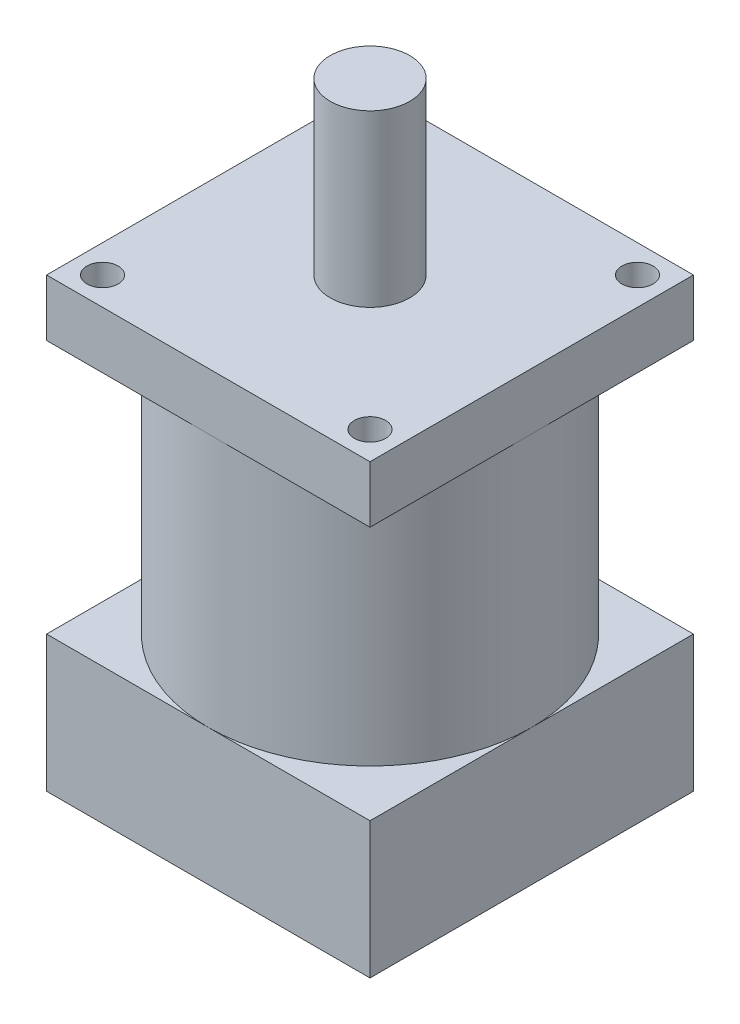
ISO-10303-21;
HEADER;
FILE_DESCRIPTION(('STEP AP214'),'2;1');
FILE_NAME('part.step','',(''),(''),'','','');
FILE_SCHEMA(('AUTOMOTIVE_DESIGN { 1 0 10303 214 1 1 1 1 }'));
ENDSEC;
DATA;
#1=APPLICATION_CONTEXT('core data for automotive mechanical design processes');
#2=APPLICATION_PROTOCOL_DEFINITION('international standard','automotive_design',2000,#1);
#3=PRODUCT_CONTEXT('',#1,'mechanical');
#4=PRODUCT('Part','Part','',(#3));
#5=PRODUCT_RELATED_PRODUCT_CATEGORY('part','',(#4));
#6=PRODUCT_DEFINITION_FORMATION('','',#4);
#7=PRODUCT_DEFINITION_CONTEXT('part definition',#1,'design');
#8=PRODUCT_DEFINITION('design','',#6,#7);
#9=PRODUCT_DEFINITION_SHAPE('','',#8);
#10=(LENGTH_UNIT() NAMED_UNIT(*) SI_UNIT(.MILLI.,.METRE.));
#11=(NAMED_UNIT(*) PLANE_ANGLE_UNIT() SI_UNIT($,.RADIAN.));
#12=(NAMED_UNIT(*) SI_UNIT($,.STERADIAN.) SOLID_ANGLE_UNIT());
#13=UNCERTAINTY_MEASURE_WITH_UNIT(LENGTH_MEASURE(1.E-05),#10,'distance_accuracy_value','');
#14=(GEOMETRIC_REPRESENTATION_CONTEXT(3) GLOBAL_UNCERTAINTY_ASSIGNED_CONTEXT((#13)) GLOBAL_UNIT_ASSIGNED_CONTEXT((#10,
#11,#12)) REPRESENTATION_CONTEXT('',''));
#15=CARTESIAN_POINT('',(0.,0.,0.));
#16=DIRECTION('',(0.,0.,1.));
#17=DIRECTION('',(1.,0.,0.));
#18=AXIS2_PLACEMENT_3D('',#15,#16,#17);
#19=CARTESIAN_POINT('',(0.,24.,0.));
#20=DIRECTION('',(0.,1.,0.));
#21=DIRECTION('',(0.,0.,1.));
#22=AXIS2_PLACEMENT_3D('',#19,#20,#21);
#23=PLANE('',#22);
#24=CARTESIAN_POINT('',(0.,24.,0.));
#25=DIRECTION('',(0.,1.,0.));
#26=DIRECTION('',(0.,0.,1.));
#27=AXIS2_PLACEMENT_3D('',#24,#25,#26);
#28=CIRCLE('',#27,28.5);
#29=CARTESIAN_POINT('',(0.,24.,28.5));
#30=VERTEX_POINT('',#29);
#31=CARTESIAN_POINT('',(28.5,24.,0.));
#32=VERTEX_POINT('',#31);
#33=EDGE_CURVE('E159',#30,#32,#28,.T.);
#34=ORIENTED_EDGE('',*,*,#33,.F.);
#35=DIRECTION('',(1.,0.,0.));
#36=VECTOR('',#35,1.);
#37=CARTESIAN_POINT('',(-28.5,24.,28.5));
#38=LINE('',#37,#36);
#39=CARTESIAN_POINT('',(28.5,24.,28.5));
#40=VERTEX_POINT('',#39);
#41=EDGE_CURVE('E191',#30,#40,#38,.T.);
#42=ORIENTED_EDGE('',*,*,#41,.T.);
#43=DIRECTION('',(0.,0.,-1.));
#44=VECTOR('',#43,1.);
#45=CARTESIAN_POINT('',(28.5,24.,-28.5));
#46=LINE('',#45,#44);
#47=EDGE_CURVE('E176',#40,#32,#46,.T.);
#48=ORIENTED_EDGE('',*,*,#47,.T.);
#49=EDGE_LOOP('',(#34,#42,#48));
#50=FACE_BOUND('',#49,.T.);
#51=ADVANCED_FACE('F39',(#50),#23,.T.);
#52=CARTESIAN_POINT('',(0.,24.,-28.5));
#53=VERTEX_POINT('',#52);
#54=EDGE_CURVE('E49',#32,#53,#28,.T.);
#55=ORIENTED_EDGE('',*,*,#54,.F.);
#56=CARTESIAN_POINT('',(28.5,24.,-28.5));
#57=VERTEX_POINT('',#56);
#58=EDGE_CURVE('E181',#32,#57,#46,.T.);
#59=ORIENTED_EDGE('',*,*,#58,.T.);
#60=DIRECTION('',(-1.,0.,0.));
#61=VECTOR('',#60,1.);
#62=CARTESIAN_POINT('',(-28.5,24.,-28.5));
#63=LINE('',#62,#61);
#64=EDGE_CURVE('E182',#57,#53,#63,.T.);
#65=ORIENTED_EDGE('',*,*,#64,.T.);
#66=EDGE_LOOP('',(#55,#59,#65));
#67=FACE_BOUND('',#66,.T.);
#68=ADVANCED_FACE('F238',(#67),#23,.T.);
#69=CARTESIAN_POINT('',(-28.5,24.,0.));
#70=VERTEX_POINT('',#69);
#71=EDGE_CURVE('E228',#53,#70,#28,.T.);
#72=ORIENTED_EDGE('',*,*,#71,.F.);
#73=CARTESIAN_POINT('',(-28.5,24.,-28.5));
#74=VERTEX_POINT('',#73);
#75=EDGE_CURVE('E180',#53,#74,#63,.T.);
#76=ORIENTED_EDGE('',*,*,#75,.T.);
#77=DIRECTION('',(0.,0.,1.));
#78=VECTOR('',#77,1.);
#79=CARTESIAN_POINT('',(-28.5,24.,-28.5));
#80=LINE('',#79,#78);
#81=EDGE_CURVE('E187',#74,#70,#80,.T.);
#82=ORIENTED_EDGE('',*,*,#81,.T.);
#83=EDGE_LOOP('',(#72,#76,#82));
#84=FACE_BOUND('',#83,.T.);
#85=ADVANCED_FACE('F259',(#84),#23,.T.);
#86=CARTESIAN_POINT('',(28.5,24.,-28.5));
#87=DIRECTION('',(-1.,0.,0.));
#88=DIRECTION('',(0.,0.,1.));
#89=AXIS2_PLACEMENT_3D('',#86,#87,#88);
#90=PLANE('',#89);
#91=DIRECTION('',(0.,0.,-1.));
#92=VECTOR('',#91,1.);
#93=CARTESIAN_POINT('',(28.5,0.,-28.5));
#94=LINE('',#93,#92);
#95=CARTESIAN_POINT('',(28.5,0.,28.5));
#96=VERTEX_POINT('',#95);
#97=CARTESIAN_POINT('',(28.5,0.,-28.5));
#98=VERTEX_POINT('',#97);
#99=EDGE_CURVE('E173',#96,#98,#94,.T.);
#100=ORIENTED_EDGE('',*,*,#99,.T.);
#101=DIRECTION('',(0.,-1.,0.));
#102=VECTOR('',#101,1.);
#103=CARTESIAN_POINT('',(28.5,24.,-28.5));
#104=LINE('',#103,#102);
#105=EDGE_CURVE('E43',#57,#98,#104,.T.);
#106=ORIENTED_EDGE('',*,*,#105,.F.);
#107=ORIENTED_EDGE('',*,*,#58,.F.);
#108=ORIENTED_EDGE('',*,*,#47,.F.);
#109=DIRECTION('',(0.,-1.,0.));
#110=VECTOR('',#109,1.);
#111=CARTESIAN_POINT('',(28.5,24.,28.5));
#112=LINE('',#111,#110);
#113=EDGE_CURVE('E195',#40,#96,#112,.T.);
#114=ORIENTED_EDGE('',*,*,#113,.T.);
#115=EDGE_LOOP('',(#100,#106,#107,#108,#114));
#116=FACE_BOUND('',#115,.T.);
#117=ADVANCED_FACE('F41',(#116),#90,.F.);
#118=CARTESIAN_POINT('',(-28.5,24.,-28.5));
#119=DIRECTION('',(0.,0.,1.));
#120=DIRECTION('',(1.,0.,0.));
#121=AXIS2_PLACEMENT_3D('',#118,#119,#120);
#122=PLANE('',#121);
#123=DIRECTION('',(-1.,0.,0.));
#124=VECTOR('',#123,1.);
#125=CARTESIAN_POINT('',(-28.5,0.,-28.5));
#126=LINE('',#125,#124);
#127=CARTESIAN_POINT('',(-28.5,0.,-28.5));
#128=VERTEX_POINT('',#127);
#129=EDGE_CURVE('E199',#98,#128,#126,.T.);
#130=ORIENTED_EDGE('',*,*,#129,.T.);
#131=DIRECTION('',(0.,-1.,0.));
#132=VECTOR('',#131,1.);
#133=CARTESIAN_POINT('',(-28.5,24.,-28.5));
#134=LINE('',#133,#132);
#135=EDGE_CURVE('E214',#74,#128,#134,.T.);
#136=ORIENTED_EDGE('',*,*,#135,.F.);
#137=ORIENTED_EDGE('',*,*,#75,.F.);
#138=ORIENTED_EDGE('',*,*,#64,.F.);
#139=ORIENTED_EDGE('',*,*,#105,.T.);
#140=EDGE_LOOP('',(#130,#136,#137,#138,#139));
#141=FACE_BOUND('',#140,.T.);
#142=ADVANCED_FACE('F253',(#141),#122,.F.);
#143=CARTESIAN_POINT('',(-28.5,24.,-28.5));
#144=DIRECTION('',(1.,0.,0.));
#145=DIRECTION('',(0.,0.,-1.));
#146=AXIS2_PLACEMENT_3D('',#143,#144,#145);
#147=PLANE('',#146);
#148=DIRECTION('',(0.,0.,1.));
#149=VECTOR('',#148,1.);
#150=CARTESIAN_POINT('',(-28.5,0.,-28.5));
#151=LINE('',#150,#149);
#152=CARTESIAN_POINT('',(-28.5,0.,28.5));
#153=VERTEX_POINT('',#152);
#154=EDGE_CURVE('E202',#128,#153,#151,.T.);
#155=ORIENTED_EDGE('',*,*,#154,.T.);
#156=DIRECTION('',(0.,-1.,0.));
#157=VECTOR('',#156,1.);
#158=CARTESIAN_POINT('',(-28.5,24.,28.5));
#159=LINE('',#158,#157);
#160=CARTESIAN_POINT('',(-28.5,24.,28.5));
#161=VERTEX_POINT('',#160);
#162=EDGE_CURVE('E211',#161,#153,#159,.T.);
#163=ORIENTED_EDGE('',*,*,#162,.F.);
#164=EDGE_CURVE('E186',#70,#161,#80,.T.);
#165=ORIENTED_EDGE('',*,*,#164,.F.);
#166=ORIENTED_EDGE('',*,*,#81,.F.);
#167=ORIENTED_EDGE('',*,*,#135,.T.);
#168=EDGE_LOOP('',(#155,#163,#165,#166,#167));
#169=FACE_BOUND('',#168,.T.);
#170=ADVANCED_FACE('F256',(#169),#147,.F.);
#171=CARTESIAN_POINT('',(-28.5,24.,28.5));
#172=DIRECTION('',(0.,0.,-1.));
#173=DIRECTION('',(-1.,0.,0.));
#174=AXIS2_PLACEMENT_3D('',#171,#172,#173);
#175=PLANE('',#174);
#176=DIRECTION('',(1.,0.,0.));
#177=VECTOR('',#176,1.);
#178=CARTESIAN_POINT('',(-28.5,0.,28.5));
#179=LINE('',#178,#177);
#180=EDGE_CURVE('E205',#153,#96,#179,.T.);
#181=ORIENTED_EDGE('',*,*,#180,.T.);
#182=ORIENTED_EDGE('',*,*,#113,.F.);
#183=ORIENTED_EDGE('',*,*,#41,.F.);
#184=EDGE_CURVE('E192',#161,#30,#38,.T.);
#185=ORIENTED_EDGE('',*,*,#184,.F.);
#186=ORIENTED_EDGE('',*,*,#162,.T.);
#187=EDGE_LOOP('',(#181,#182,#183,#185,#186));
#188=FACE_BOUND('',#187,.T.);
#189=ADVANCED_FACE('F248',(#188),#175,.F.);
#190=EDGE_CURVE('E165',#70,#30,#28,.T.);
#191=ORIENTED_EDGE('',*,*,#190,.F.);
#192=ORIENTED_EDGE('',*,*,#164,.T.);
#193=ORIENTED_EDGE('',*,*,#184,.T.);
#194=EDGE_LOOP('',(#191,#192,#193));
#195=FACE_BOUND('',#194,.T.);
#196=ADVANCED_FACE('F325',(#195),#23,.T.);
#197=CARTESIAN_POINT('',(0.,0.,0.));
#198=DIRECTION('',(0.,1.,0.));
#199=DIRECTION('',(0.,0.,1.));
#200=AXIS2_PLACEMENT_3D('',#197,#198,#199);
#201=PLANE('',#200);
#202=CARTESIAN_POINT('',(-23.57,0.,23.57));
#203=DIRECTION('',(0.,-1.,0.));
#204=DIRECTION('',(0.,0.,-1.));
#205=AXIS2_PLACEMENT_3D('',#202,#203,#204);
#206=CIRCLE('',#205,2.);
#207=CARTESIAN_POINT('',(-23.57,0.,21.57));
#208=VERTEX_POINT('',#207);
#209=EDGE_CURVE('E587',#208,#208,#206,.T.);
#210=ORIENTED_EDGE('',*,*,#209,.F.);
#211=EDGE_LOOP('',(#210));
#212=FACE_BOUND('',#211,.T.);
#213=CARTESIAN_POINT('',(23.57,0.,23.57));
#214=DIRECTION('',(0.,-1.,0.));
#215=DIRECTION('',(0.,0.,-1.));
#216=AXIS2_PLACEMENT_3D('',#213,#214,#215);
#217=CIRCLE('',#216,2.);
#218=CARTESIAN_POINT('',(23.57,0.,21.57));
#219=VERTEX_POINT('',#218);
#220=EDGE_CURVE('E586',#219,#219,#217,.T.);
#221=ORIENTED_EDGE('',*,*,#220,.F.);
#222=EDGE_LOOP('',(#221));
#223=FACE_BOUND('',#222,.T.);
#224=CARTESIAN_POINT('',(23.57,0.,-23.57));
#225=DIRECTION('',(0.,-1.,0.));
#226=DIRECTION('',(0.,0.,-1.));
#227=AXIS2_PLACEMENT_3D('',#224,#225,#226);
#228=CIRCLE('',#227,2.);
#229=CARTESIAN_POINT('',(23.57,0.,-25.57));
#230=VERTEX_POINT('',#229);
#231=EDGE_CURVE('E649',#230,#230,#228,.T.);
#232=ORIENTED_EDGE('',*,*,#231,.F.);
#233=EDGE_LOOP('',(#232));
#234=FACE_BOUND('',#233,.T.);
#235=CARTESIAN_POINT('',(-23.57,0.,-23.57));
#236=DIRECTION('',(0.,-1.,0.));
#237=DIRECTION('',(0.,0.,-1.));
#238=AXIS2_PLACEMENT_3D('',#235,#236,#237);
#239=CIRCLE('',#238,2.);
#240=CARTESIAN_POINT('',(-23.57,0.,-25.57));
#241=VERTEX_POINT('',#240);
#242=EDGE_CURVE('E603',#241,#241,#239,.T.);
#243=ORIENTED_EDGE('',*,*,#242,.F.);
#244=EDGE_LOOP('',(#243));
#245=FACE_BOUND('',#244,.T.);
#246=ORIENTED_EDGE('',*,*,#99,.F.);
#247=ORIENTED_EDGE('',*,*,#180,.F.);
#248=ORIENTED_EDGE('',*,*,#154,.F.);
#249=ORIENTED_EDGE('',*,*,#129,.F.);
#250=EDGE_LOOP('',(#246,#247,#248,#249));
#251=FACE_BOUND('',#250,.T.);
#252=ADVANCED_FACE('F252',(#212,#223,#234,#245,#251),#201,.F.);
#253=CARTESIAN_POINT('',(0.,68.8,0.));
#254=DIRECTION('',(0.,-1.,0.));
#255=DIRECTION('',(0.,0.,-1.));
#256=AXIS2_PLACEMENT_3D('',#253,#254,#255);
#257=CYLINDRICAL_SURFACE('',#256,28.5);
#258=CARTESIAN_POINT('',(0.,68.8,0.));
#259=DIRECTION('',(0.,1.,0.));
#260=DIRECTION('',(0.,0.,1.));
#261=AXIS2_PLACEMENT_3D('',#258,#259,#260);
#262=CIRCLE('',#261,28.5);
#263=CARTESIAN_POINT('',(0.,68.8,28.5));
#264=VERTEX_POINT('',#263);
#265=CARTESIAN_POINT('',(28.5,68.8,0.));
#266=VERTEX_POINT('',#265);
#267=EDGE_CURVE('E170',#264,#266,#262,.T.);
#268=ORIENTED_EDGE('',*,*,#267,.F.);
#269=CARTESIAN_POINT('',(-28.5,68.8,0.));
#270=VERTEX_POINT('',#269);
#271=EDGE_CURVE('E57',#270,#264,#262,.T.);
#272=ORIENTED_EDGE('',*,*,#271,.F.);
#273=CARTESIAN_POINT('',(0.,68.8,-28.5));
#274=VERTEX_POINT('',#273);
#275=EDGE_CURVE('E61',#274,#270,#262,.T.);
#276=ORIENTED_EDGE('',*,*,#275,.F.);
#277=EDGE_CURVE('E174',#266,#274,#262,.T.);
#278=ORIENTED_EDGE('',*,*,#277,.F.);
#279=EDGE_LOOP('',(#268,#272,#276,#278));
#280=FACE_BOUND('',#279,.T.);
#281=ORIENTED_EDGE('',*,*,#33,.T.);
#282=ORIENTED_EDGE('',*,*,#54,.T.);
#283=ORIENTED_EDGE('',*,*,#71,.T.);
#284=ORIENTED_EDGE('',*,*,#190,.T.);
#285=EDGE_LOOP('',(#281,#282,#283,#284));
#286=FACE_BOUND('',#285,.T.);
#287=ADVANCED_FACE('F234',(#280,#286),#257,.T.);
#288=CARTESIAN_POINT('',(0.,68.8,0.));
#289=DIRECTION('',(0.,1.,0.));
#290=DIRECTION('',(0.,0.,1.));
#291=AXIS2_PLACEMENT_3D('',#288,#289,#290);
#292=PLANE('',#291);
#293=CARTESIAN_POINT('',(23.57,68.8,23.57));
#294=DIRECTION('',(0.,1.,0.));
#295=DIRECTION('',(0.,0.,1.));
#296=AXIS2_PLACEMENT_3D('',#293,#294,#295);
#297=CIRCLE('',#296,2.75);
#298=CARTESIAN_POINT('',(23.57,68.8,26.32));
#299=VERTEX_POINT('',#298);
#300=EDGE_CURVE('E623',#299,#299,#297,.T.);
#301=ORIENTED_EDGE('',*,*,#300,.T.);
#302=EDGE_LOOP('',(#301));
#303=FACE_BOUND('',#302,.T.);
#304=DIRECTION('',(1.,0.,0.));
#305=VECTOR('',#304,1.);
#306=CARTESIAN_POINT('',(-28.5,68.8,28.5));
#307=LINE('',#306,#305);
#308=CARTESIAN_POINT('',(28.5,68.8,28.5));
#309=VERTEX_POINT('',#308);
#310=EDGE_CURVE('E275',#264,#309,#307,.T.);
#311=ORIENTED_EDGE('',*,*,#310,.F.);
#312=ORIENTED_EDGE('',*,*,#267,.T.);
#313=DIRECTION('',(0.,0.,-1.));
#314=VECTOR('',#313,1.);
#315=CARTESIAN_POINT('',(28.5,68.8,-28.5));
#316=LINE('',#315,#314);
#317=EDGE_CURVE('E277',#309,#266,#316,.T.);
#318=ORIENTED_EDGE('',*,*,#317,.F.);
#319=EDGE_LOOP('',(#311,#312,#318));
#320=FACE_BOUND('',#319,.T.);
#321=ADVANCED_FACE('F276',(#303,#320),#292,.F.);
#322=CARTESIAN_POINT('',(23.57,68.8,-23.57));
#323=DIRECTION('',(0.,1.,0.));
#324=DIRECTION('',(0.,0.,1.));
#325=AXIS2_PLACEMENT_3D('',#322,#323,#324);
#326=CIRCLE('',#325,2.75);
#327=CARTESIAN_POINT('',(23.57,68.8,-20.82));
#328=VERTEX_POINT('',#327);
#329=EDGE_CURVE('E634',#328,#328,#326,.T.);
#330=ORIENTED_EDGE('',*,*,#329,.T.);
#331=EDGE_LOOP('',(#330));
#332=FACE_BOUND('',#331,.T.);
#333=CARTESIAN_POINT('',(28.5,68.8,-28.5));
#334=VERTEX_POINT('',#333);
#335=EDGE_CURVE('E156',#266,#334,#316,.T.);
#336=ORIENTED_EDGE('',*,*,#335,.F.);
#337=ORIENTED_EDGE('',*,*,#277,.T.);
#338=DIRECTION('',(-1.,0.,0.));
#339=VECTOR('',#338,1.);
#340=CARTESIAN_POINT('',(-28.5,68.8,-28.5));
#341=LINE('',#340,#339);
#342=EDGE_CURVE('E299',#334,#274,#341,.T.);
#343=ORIENTED_EDGE('',*,*,#342,.F.);
#344=EDGE_LOOP('',(#336,#337,#343));
#345=FACE_BOUND('',#344,.T.);
#346=ADVANCED_FACE('F311',(#332,#345),#292,.F.);
#347=CARTESIAN_POINT('',(-23.57,68.8,-23.57));
#348=DIRECTION('',(0.,1.,0.));
#349=DIRECTION('',(0.,0.,1.));
#350=AXIS2_PLACEMENT_3D('',#347,#348,#349);
#351=CIRCLE('',#350,2.75);
#352=CARTESIAN_POINT('',(-23.57,68.8,-20.82));
#353=VERTEX_POINT('',#352);
#354=EDGE_CURVE('E631',#353,#353,#351,.T.);
#355=ORIENTED_EDGE('',*,*,#354,.T.);
#356=EDGE_LOOP('',(#355));
#357=FACE_BOUND('',#356,.T.);
#358=CARTESIAN_POINT('',(-28.5,68.8,-28.5));
#359=VERTEX_POINT('',#358);
#360=EDGE_CURVE('E298',#274,#359,#341,.T.);
#361=ORIENTED_EDGE('',*,*,#360,.F.);
#362=ORIENTED_EDGE('',*,*,#275,.T.);
#363=DIRECTION('',(0.,0.,1.));
#364=VECTOR('',#363,1.);
#365=CARTESIAN_POINT('',(-28.5,68.8,-28.5));
#366=LINE('',#365,#364);
#367=EDGE_CURVE('E280',#359,#270,#366,.T.);
#368=ORIENTED_EDGE('',*,*,#367,.F.);
#369=EDGE_LOOP('',(#361,#362,#368));
#370=FACE_BOUND('',#369,.T.);
#371=ADVANCED_FACE('F308',(#357,#370),#292,.F.);
#372=CARTESIAN_POINT('',(-23.57,68.8,23.57));
#373=DIRECTION('',(0.,1.,0.));
#374=DIRECTION('',(0.,0.,1.));
#375=AXIS2_PLACEMENT_3D('',#372,#373,#374);
#376=CIRCLE('',#375,2.75);
#377=CARTESIAN_POINT('',(-23.57,68.8,26.32));
#378=VERTEX_POINT('',#377);
#379=EDGE_CURVE('E627',#378,#378,#376,.T.);
#380=ORIENTED_EDGE('',*,*,#379,.T.);
#381=EDGE_LOOP('',(#380));
#382=FACE_BOUND('',#381,.T.);
#383=CARTESIAN_POINT('',(-28.5,68.8,28.5));
#384=VERTEX_POINT('',#383);
#385=EDGE_CURVE('E271',#270,#384,#366,.T.);
#386=ORIENTED_EDGE('',*,*,#385,.F.);
#387=ORIENTED_EDGE('',*,*,#271,.T.);
#388=EDGE_CURVE('E151',#384,#264,#307,.T.);
#389=ORIENTED_EDGE('',*,*,#388,.F.);
#390=EDGE_LOOP('',(#386,#387,#389));
#391=FACE_BOUND('',#390,.T.);
#392=ADVANCED_FACE('F269',(#382,#391),#292,.F.);
#393=CARTESIAN_POINT('',(28.5,78.8,-28.5));
#394=DIRECTION('',(-1.,0.,0.));
#395=DIRECTION('',(0.,0.,1.));
#396=AXIS2_PLACEMENT_3D('',#393,#394,#395);
#397=PLANE('',#396);
#398=ORIENTED_EDGE('',*,*,#317,.T.);
#399=ORIENTED_EDGE('',*,*,#335,.T.);
#400=DIRECTION('',(0.,-1.,0.));
#401=VECTOR('',#400,1.);
#402=CARTESIAN_POINT('',(28.5,78.8,-28.5));
#403=LINE('',#402,#401);
#404=CARTESIAN_POINT('',(28.5,78.8,-28.5));
#405=VERTEX_POINT('',#404);
#406=EDGE_CURVE('E134',#405,#334,#403,.T.);
#407=ORIENTED_EDGE('',*,*,#406,.F.);
#408=DIRECTION('',(0.,0.,-1.));
#409=VECTOR('',#408,1.);
#410=CARTESIAN_POINT('',(28.5,78.8,-28.5));
#411=LINE('',#410,#409);
#412=CARTESIAN_POINT('',(28.5,78.8,28.5));
#413=VERTEX_POINT('',#412);
#414=EDGE_CURVE('E141',#413,#405,#411,.T.);
#415=ORIENTED_EDGE('',*,*,#414,.F.);
#416=DIRECTION('',(0.,-1.,0.));
#417=VECTOR('',#416,1.);
#418=CARTESIAN_POINT('',(28.5,78.8,28.5));
#419=LINE('',#418,#417);
#420=EDGE_CURVE('E289',#413,#309,#419,.T.);
#421=ORIENTED_EDGE('',*,*,#420,.T.);
#422=EDGE_LOOP('',(#398,#399,#407,#415,#421));
#423=FACE_BOUND('',#422,.T.);
#424=ADVANCED_FACE('F154',(#423),#397,.F.);
#425=CARTESIAN_POINT('',(-28.5,78.8,-28.5));
#426=DIRECTION('',(0.,0.,1.));
#427=DIRECTION('',(1.,0.,0.));
#428=AXIS2_PLACEMENT_3D('',#425,#426,#427);
#429=PLANE('',#428);
#430=ORIENTED_EDGE('',*,*,#342,.T.);
#431=ORIENTED_EDGE('',*,*,#360,.T.);
#432=DIRECTION('',(0.,-1.,0.));
#433=VECTOR('',#432,1.);
#434=CARTESIAN_POINT('',(-28.5,78.8,-28.5));
#435=LINE('',#434,#433);
#436=CARTESIAN_POINT('',(-28.5,78.8,-28.5));
#437=VERTEX_POINT('',#436);
#438=EDGE_CURVE('E136',#437,#359,#435,.T.);
#439=ORIENTED_EDGE('',*,*,#438,.F.);
#440=DIRECTION('',(-1.,0.,0.));
#441=VECTOR('',#440,1.);
#442=CARTESIAN_POINT('',(-28.5,78.8,-28.5));
#443=LINE('',#442,#441);
#444=EDGE_CURVE('E129',#405,#437,#443,.T.);
#445=ORIENTED_EDGE('',*,*,#444,.F.);
#446=ORIENTED_EDGE('',*,*,#406,.T.);
#447=EDGE_LOOP('',(#430,#431,#439,#445,#446));
#448=FACE_BOUND('',#447,.T.);
#449=ADVANCED_FACE('F132',(#448),#429,.F.);
#450=CARTESIAN_POINT('',(-28.5,78.8,-28.5));
#451=DIRECTION('',(1.,0.,0.));
#452=DIRECTION('',(0.,0.,-1.));
#453=AXIS2_PLACEMENT_3D('',#450,#451,#452);
#454=PLANE('',#453);
#455=ORIENTED_EDGE('',*,*,#367,.T.);
#456=ORIENTED_EDGE('',*,*,#385,.T.);
#457=DIRECTION('',(0.,-1.,0.));
#458=VECTOR('',#457,1.);
#459=CARTESIAN_POINT('',(-28.5,78.8,28.5));
#460=LINE('',#459,#458);
#461=CARTESIAN_POINT('',(-28.5,78.8,28.5));
#462=VERTEX_POINT('',#461);
#463=EDGE_CURVE('E166',#462,#384,#460,.T.);
#464=ORIENTED_EDGE('',*,*,#463,.F.);
#465=DIRECTION('',(0.,0.,1.));
#466=VECTOR('',#465,1.);
#467=CARTESIAN_POINT('',(-28.5,78.8,-28.5));
#468=LINE('',#467,#466);
#469=EDGE_CURVE('E140',#437,#462,#468,.T.);
#470=ORIENTED_EDGE('',*,*,#469,.F.);
#471=ORIENTED_EDGE('',*,*,#438,.T.);
#472=EDGE_LOOP('',(#455,#456,#464,#470,#471));
#473=FACE_BOUND('',#472,.T.);
#474=ADVANCED_FACE('F307',(#473),#454,.F.);
#475=CARTESIAN_POINT('',(-28.5,78.8,28.5));
#476=DIRECTION('',(0.,0.,-1.));
#477=DIRECTION('',(-1.,0.,0.));
#478=AXIS2_PLACEMENT_3D('',#475,#476,#477);
#479=PLANE('',#478);
#480=ORIENTED_EDGE('',*,*,#388,.T.);
#481=ORIENTED_EDGE('',*,*,#310,.T.);
#482=ORIENTED_EDGE('',*,*,#420,.F.);
#483=DIRECTION('',(1.,0.,0.));
#484=VECTOR('',#483,1.);
#485=CARTESIAN_POINT('',(-28.5,78.8,28.5));
#486=LINE('',#485,#484);
#487=EDGE_CURVE('E146',#462,#413,#486,.T.);
#488=ORIENTED_EDGE('',*,*,#487,.F.);
#489=ORIENTED_EDGE('',*,*,#463,.T.);
#490=EDGE_LOOP('',(#480,#481,#482,#488,#489));
#491=FACE_BOUND('',#490,.T.);
#492=ADVANCED_FACE('F283',(#491),#479,.F.);
#493=CARTESIAN_POINT('',(0.,78.8,0.));
#494=DIRECTION('',(0.,1.,0.));
#495=DIRECTION('',(0.,0.,1.));
#496=AXIS2_PLACEMENT_3D('',#493,#494,#495);
#497=PLANE('',#496);
#498=CARTESIAN_POINT('',(23.57,78.8,-23.57));
#499=DIRECTION('',(0.,1.,0.));
#500=DIRECTION('',(0.,0.,1.));
#501=AXIS2_PLACEMENT_3D('',#498,#499,#500);
#502=CIRCLE('',#501,2.75);
#503=CARTESIAN_POINT('',(23.57,78.8,-20.82));
#504=VERTEX_POINT('',#503);
#505=EDGE_CURVE('E602',#504,#504,#502,.T.);
#506=ORIENTED_EDGE('',*,*,#505,.F.);
#507=EDGE_LOOP('',(#506));
#508=FACE_BOUND('',#507,.T.);
#509=CARTESIAN_POINT('',(-23.57,78.8,-23.57));
#510=DIRECTION('',(0.,1.,0.));
#511=DIRECTION('',(0.,0.,1.));
#512=AXIS2_PLACEMENT_3D('',#509,#510,#511);
#513=CIRCLE('',#512,2.75);
#514=CARTESIAN_POINT('',(-23.57,78.8,-20.82));
#515=VERTEX_POINT('',#514);
#516=EDGE_CURVE('E613',#515,#515,#513,.T.);
#517=ORIENTED_EDGE('',*,*,#516,.F.);
#518=EDGE_LOOP('',(#517));
#519=FACE_BOUND('',#518,.T.);
#520=CARTESIAN_POINT('',(-23.57,78.8,23.57));
#521=DIRECTION('',(0.,1.,0.));
#522=DIRECTION('',(0.,0.,1.));
#523=AXIS2_PLACEMENT_3D('',#520,#521,#522);
#524=CIRCLE('',#523,2.75);
#525=CARTESIAN_POINT('',(-23.57,78.8,26.32));
#526=VERTEX_POINT('',#525);
#527=EDGE_CURVE('E608',#526,#526,#524,.T.);
#528=ORIENTED_EDGE('',*,*,#527,.F.);
#529=EDGE_LOOP('',(#528));
#530=FACE_BOUND('',#529,.T.);
#531=CARTESIAN_POINT('',(23.57,78.8,23.57));
#532=DIRECTION('',(0.,1.,0.));
#533=DIRECTION('',(0.,0.,1.));
#534=AXIS2_PLACEMENT_3D('',#531,#532,#533);
#535=CIRCLE('',#534,2.75);
#536=CARTESIAN_POINT('',(23.57,78.8,26.32));
#537=VERTEX_POINT('',#536);
#538=EDGE_CURVE('E612',#537,#537,#535,.T.);
#539=ORIENTED_EDGE('',*,*,#538,.F.);
#540=EDGE_LOOP('',(#539));
#541=FACE_BOUND('',#540,.T.);
#542=CARTESIAN_POINT('',(0.,78.8,0.));
#543=DIRECTION('',(0.,1.,0.));
#544=DIRECTION('',(0.,0.,1.));
#545=AXIS2_PLACEMENT_3D('',#542,#543,#544);
#546=CIRCLE('',#545,7.);
#547=CARTESIAN_POINT('',(0.,78.8,7.));
#548=VERTEX_POINT('',#547);
#549=EDGE_CURVE('E11',#548,#548,#546,.T.);
#550=ORIENTED_EDGE('',*,*,#549,.F.);
#551=EDGE_LOOP('',(#550));
#552=FACE_BOUND('',#551,.T.);
#553=ORIENTED_EDGE('',*,*,#414,.T.);
#554=ORIENTED_EDGE('',*,*,#444,.T.);
#555=ORIENTED_EDGE('',*,*,#469,.T.);
#556=ORIENTED_EDGE('',*,*,#487,.T.);
#557=EDGE_LOOP('',(#553,#554,#555,#556));
#558=FACE_BOUND('',#557,.T.);
#559=ADVANCED_FACE('F144',(#508,#519,#530,#541,#552,#558),#497,.T.);
#560=CARTESIAN_POINT('',(0.,108.8,0.));
#561=DIRECTION('',(0.,-1.,0.));
#562=DIRECTION('',(0.,0.,-1.));
#563=AXIS2_PLACEMENT_3D('',#560,#561,#562);
#564=CYLINDRICAL_SURFACE('',#563,7.);
#565=CARTESIAN_POINT('',(0.,108.8,0.));
#566=DIRECTION('',(0.,1.,0.));
#567=DIRECTION('',(0.,0.,1.));
#568=AXIS2_PLACEMENT_3D('',#565,#566,#567);
#569=CIRCLE('',#568,7.);
#570=CARTESIAN_POINT('',(0.,108.8,7.));
#571=VERTEX_POINT('',#570);
#572=EDGE_CURVE('E638',#571,#571,#569,.T.);
#573=ORIENTED_EDGE('',*,*,#572,.F.);
#574=EDGE_LOOP('',(#573));
#575=FACE_BOUND('',#574,.T.);
#576=ORIENTED_EDGE('',*,*,#549,.T.);
#577=EDGE_LOOP('',(#576));
#578=FACE_BOUND('',#577,.T.);
#579=ADVANCED_FACE('F410',(#575,#578),#564,.T.);
#580=CARTESIAN_POINT('',(0.,108.8,0.));
#581=DIRECTION('',(0.,1.,0.));
#582=DIRECTION('',(0.,0.,1.));
#583=AXIS2_PLACEMENT_3D('',#580,#581,#582);
#584=PLANE('',#583);
#585=ORIENTED_EDGE('',*,*,#572,.T.);
#586=EDGE_LOOP('',(#585));
#587=FACE_BOUND('',#586,.T.);
#588=ADVANCED_FACE('F415',(#587),#584,.T.);
#589=CARTESIAN_POINT('',(23.57,48.8,23.57));
#590=DIRECTION('',(0.,1.,0.));
#591=DIRECTION('',(0.,0.,1.));
#592=AXIS2_PLACEMENT_3D('',#589,#590,#591);
#593=CYLINDRICAL_SURFACE('',#592,2.75);
#594=ORIENTED_EDGE('',*,*,#538,.T.);
#595=EDGE_LOOP('',(#594));
#596=FACE_BOUND('',#595,.T.);
#597=ORIENTED_EDGE('',*,*,#300,.F.);
#598=EDGE_LOOP('',(#597));
#599=FACE_BOUND('',#598,.T.);
#600=ADVANCED_FACE('F425',(#596,#599),#593,.F.);
#601=CARTESIAN_POINT('',(-23.57,48.8,23.57));
#602=DIRECTION('',(0.,1.,0.));
#603=DIRECTION('',(0.,0.,1.));
#604=AXIS2_PLACEMENT_3D('',#601,#602,#603);
#605=CYLINDRICAL_SURFACE('',#604,2.75);
#606=ORIENTED_EDGE('',*,*,#527,.T.);
#607=EDGE_LOOP('',(#606));
#608=FACE_BOUND('',#607,.T.);
#609=ORIENTED_EDGE('',*,*,#379,.F.);
#610=EDGE_LOOP('',(#609));
#611=FACE_BOUND('',#610,.T.);
#612=ADVANCED_FACE('F462',(#608,#611),#605,.F.);
#613=CARTESIAN_POINT('',(-23.57,48.8,-23.57));
#614=DIRECTION('',(0.,1.,0.));
#615=DIRECTION('',(0.,0.,1.));
#616=AXIS2_PLACEMENT_3D('',#613,#614,#615);
#617=CYLINDRICAL_SURFACE('',#616,2.75);
#618=ORIENTED_EDGE('',*,*,#516,.T.);
#619=EDGE_LOOP('',(#618));
#620=FACE_BOUND('',#619,.T.);
#621=ORIENTED_EDGE('',*,*,#354,.F.);
#622=EDGE_LOOP('',(#621));
#623=FACE_BOUND('',#622,.T.);
#624=ADVANCED_FACE('F472',(#620,#623),#617,.F.);
#625=CARTESIAN_POINT('',(23.57,48.8,-23.57));
#626=DIRECTION('',(0.,1.,0.));
#627=DIRECTION('',(0.,0.,1.));
#628=AXIS2_PLACEMENT_3D('',#625,#626,#627);
#629=CYLINDRICAL_SURFACE('',#628,2.75);
#630=ORIENTED_EDGE('',*,*,#505,.T.);
#631=EDGE_LOOP('',(#630));
#632=FACE_BOUND('',#631,.T.);
#633=ORIENTED_EDGE('',*,*,#329,.F.);
#634=EDGE_LOOP('',(#633));
#635=FACE_BOUND('',#634,.T.);
#636=ADVANCED_FACE('F482',(#632,#635),#629,.F.);
#637=CARTESIAN_POINT('',(-23.57,5.,-23.57));
#638=DIRECTION('',(0.,-1.,0.));
#639=DIRECTION('',(0.,0.,-1.));
#640=AXIS2_PLACEMENT_3D('',#637,#638,#639);
#641=CYLINDRICAL_SURFACE('',#640,2.);
#642=CARTESIAN_POINT('',(-23.57,5.,-23.57));
#643=DIRECTION('',(0.,-1.,0.));
#644=DIRECTION('',(0.,0.,-1.));
#645=AXIS2_PLACEMENT_3D('',#642,#643,#644);
#646=CIRCLE('',#645,2.);
#647=CARTESIAN_POINT('',(-23.57,5.,-25.57));
#648=VERTEX_POINT('',#647);
#649=EDGE_CURVE('E598',#648,#648,#646,.T.);
#650=ORIENTED_EDGE('',*,*,#649,.F.);
#651=EDGE_LOOP('',(#650));
#652=FACE_BOUND('',#651,.T.);
#653=ORIENTED_EDGE('',*,*,#242,.T.);
#654=EDGE_LOOP('',(#653));
#655=FACE_BOUND('',#654,.T.);
#656=ADVANCED_FACE('F492',(#652,#655),#641,.F.);
#657=CARTESIAN_POINT('',(-23.57,5.,-23.57));
#658=DIRECTION('',(0.,-1.,0.));
#659=DIRECTION('',(0.,0.,-1.));
#660=AXIS2_PLACEMENT_3D('',#657,#658,#659);
#661=PLANE('',#660);
#662=ORIENTED_EDGE('',*,*,#649,.T.);
#663=EDGE_LOOP('',(#662));
#664=FACE_BOUND('',#663,.T.);
#665=ADVANCED_FACE('F508',(#664),#661,.T.);
#666=CARTESIAN_POINT('',(23.57,5.,-23.57));
#667=DIRECTION('',(0.,-1.,0.));
#668=DIRECTION('',(0.,0.,-1.));
#669=AXIS2_PLACEMENT_3D('',#666,#667,#668);
#670=CYLINDRICAL_SURFACE('',#669,2.);
#671=CARTESIAN_POINT('',(23.57,5.,-23.57));
#672=DIRECTION('',(0.,-1.,0.));
#673=DIRECTION('',(0.,0.,-1.));
#674=AXIS2_PLACEMENT_3D('',#671,#672,#673);
#675=CIRCLE('',#674,2.);
#676=CARTESIAN_POINT('',(23.57,5.,-25.57));
#677=VERTEX_POINT('',#676);
#678=EDGE_CURVE('E607',#677,#677,#675,.T.);
#679=ORIENTED_EDGE('',*,*,#678,.F.);
#680=EDGE_LOOP('',(#679));
#681=FACE_BOUND('',#680,.T.);
#682=ORIENTED_EDGE('',*,*,#231,.T.);
#683=EDGE_LOOP('',(#682));
#684=FACE_BOUND('',#683,.T.);
#685=ADVANCED_FACE('F518',(#681,#684),#670,.F.);
#686=CARTESIAN_POINT('',(23.57,5.,-23.57));
#687=DIRECTION('',(0.,-1.,0.));
#688=DIRECTION('',(0.,0.,-1.));
#689=AXIS2_PLACEMENT_3D('',#686,#687,#688);
#690=PLANE('',#689);
#691=ORIENTED_EDGE('',*,*,#678,.T.);
#692=EDGE_LOOP('',(#691));
#693=FACE_BOUND('',#692,.T.);
#694=ADVANCED_FACE('F528',(#693),#690,.T.);
#695=CARTESIAN_POINT('',(23.57,5.,23.57));
#696=DIRECTION('',(0.,-1.,0.));
#697=DIRECTION('',(0.,0.,-1.));
#698=AXIS2_PLACEMENT_3D('',#695,#696,#697);
#699=CYLINDRICAL_SURFACE('',#698,2.);
#700=CARTESIAN_POINT('',(23.57,5.,23.57));
#701=DIRECTION('',(0.,-1.,0.));
#702=DIRECTION('',(0.,0.,-1.));
#703=AXIS2_PLACEMENT_3D('',#700,#701,#702);
#704=CIRCLE('',#703,2.);
#705=CARTESIAN_POINT('',(23.57,5.,21.57));
#706=VERTEX_POINT('',#705);
#707=EDGE_CURVE('E592',#706,#706,#704,.T.);
#708=ORIENTED_EDGE('',*,*,#707,.F.);
#709=EDGE_LOOP('',(#708));
#710=FACE_BOUND('',#709,.T.);
#711=ORIENTED_EDGE('',*,*,#220,.T.);
#712=EDGE_LOOP('',(#711));
#713=FACE_BOUND('',#712,.T.);
#714=ADVANCED_FACE('F538',(#710,#713),#699,.F.);
#715=CARTESIAN_POINT('',(23.57,5.,23.57));
#716=DIRECTION('',(0.,-1.,0.));
#717=DIRECTION('',(0.,0.,-1.));
#718=AXIS2_PLACEMENT_3D('',#715,#716,#717);
#719=PLANE('',#718);
#720=ORIENTED_EDGE('',*,*,#707,.T.);
#721=EDGE_LOOP('',(#720));
#722=FACE_BOUND('',#721,.T.);
#723=ADVANCED_FACE('F548',(#722),#719,.T.);
#724=CARTESIAN_POINT('',(-23.57,5.,23.57));
#725=DIRECTION('',(0.,-1.,0.));
#726=DIRECTION('',(0.,0.,-1.));
#727=AXIS2_PLACEMENT_3D('',#724,#725,#726);
#728=CYLINDRICAL_SURFACE('',#727,2.);
#729=CARTESIAN_POINT('',(-23.57,5.,23.57));
#730=DIRECTION('',(0.,-1.,0.));
#731=DIRECTION('',(0.,0.,-1.));
#732=AXIS2_PLACEMENT_3D('',#729,#730,#731);
#733=CIRCLE('',#732,2.);
#734=CARTESIAN_POINT('',(-23.57,5.,21.57));
#735=VERTEX_POINT('',#734);
#736=EDGE_CURVE('E584',#735,#735,#733,.T.);
#737=ORIENTED_EDGE('',*,*,#736,.F.);
#738=EDGE_LOOP('',(#737));
#739=FACE_BOUND('',#738,.T.);
#740=ORIENTED_EDGE('',*,*,#209,.T.);
#741=EDGE_LOOP('',(#740));
#742=FACE_BOUND('',#741,.T.);
#743=ADVANCED_FACE('F558',(#739,#742),#728,.F.);
#744=CARTESIAN_POINT('',(-23.57,5.,23.57));
#745=DIRECTION('',(0.,-1.,0.));
#746=DIRECTION('',(0.,0.,-1.));
#747=AXIS2_PLACEMENT_3D('',#744,#745,#746);
#748=PLANE('',#747);
#749=ORIENTED_EDGE('',*,*,#736,.T.);
#750=EDGE_LOOP('',(#749));
#751=FACE_BOUND('',#750,.T.);
#752=ADVANCED_FACE('F568',(#751),#748,.T.);
#753=CLOSED_SHELL('',(#51,#68,#85,#117,#142,#170,#189,#196,#252,#287,#321,#346,#371,#392,#424,
#449,#474,#492,#559,#579,#588,#600,#612,#624,#636,#656,#665,#685,#694,#714,#723,#743,#752));
#754=MANIFOLD_SOLID_BREP('B2',#753);
#755=ADVANCED_BREP_SHAPE_REPRESENTATION('',(#18,#754),#14);
#756=SHAPE_DEFINITION_REPRESENTATION(#9,#755);
ENDSEC;
END-ISO-10303-21;
